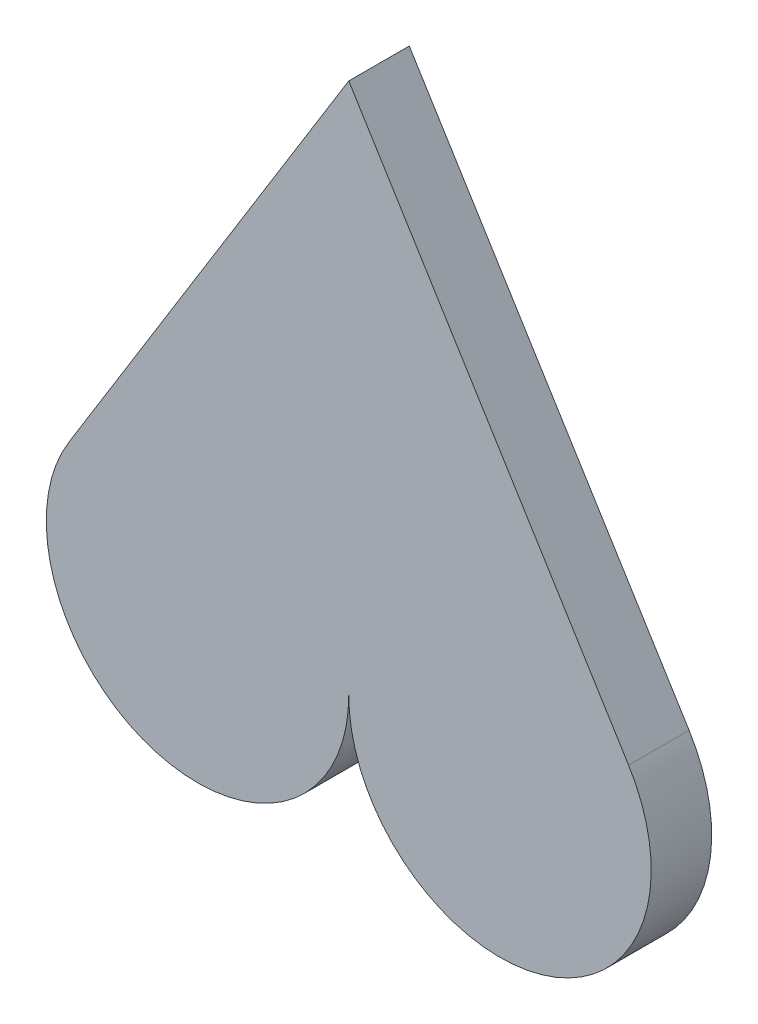
ISO-10303-21;
HEADER;
FILE_DESCRIPTION(('STEP AP214'),'2;1');
FILE_NAME('part.step','',(''),(''),'','','');
FILE_SCHEMA(('AUTOMOTIVE_DESIGN { 1 0 10303 214 1 1 1 1 }'));
ENDSEC;
DATA;
#1=APPLICATION_CONTEXT('core data for automotive mechanical design processes');
#2=APPLICATION_PROTOCOL_DEFINITION('international standard','automotive_design',2000,#1);
#3=PRODUCT_CONTEXT('',#1,'mechanical');
#4=PRODUCT('Part','Part','',(#3));
#5=PRODUCT_RELATED_PRODUCT_CATEGORY('part','',(#4));
#6=PRODUCT_DEFINITION_FORMATION('','',#4);
#7=PRODUCT_DEFINITION_CONTEXT('part definition',#1,'design');
#8=PRODUCT_DEFINITION('design','',#6,#7);
#9=PRODUCT_DEFINITION_SHAPE('','',#8);
#10=(LENGTH_UNIT() NAMED_UNIT(*) SI_UNIT(.MILLI.,.METRE.));
#11=(NAMED_UNIT(*) PLANE_ANGLE_UNIT() SI_UNIT($,.RADIAN.));
#12=(NAMED_UNIT(*) SI_UNIT($,.STERADIAN.) SOLID_ANGLE_UNIT());
#13=UNCERTAINTY_MEASURE_WITH_UNIT(LENGTH_MEASURE(1.E-05),#10,'distance_accuracy_value','');
#14=(GEOMETRIC_REPRESENTATION_CONTEXT(3) GLOBAL_UNCERTAINTY_ASSIGNED_CONTEXT((#13)) GLOBAL_UNIT_ASSIGNED_CONTEXT((#10,
#11,#12)) REPRESENTATION_CONTEXT('',''));
#15=CARTESIAN_POINT('',(0.,0.,0.));
#16=DIRECTION('',(0.,0.,1.));
#17=DIRECTION('',(1.,0.,0.));
#18=AXIS2_PLACEMENT_3D('',#15,#16,#17);
#19=CARTESIAN_POINT('',(-15.0005941465236,-52.7900822735894,-6.));
#20=DIRECTION('',(0.,0.,1.));
#21=DIRECTION('',(1.,0.,0.));
#22=AXIS2_PLACEMENT_3D('',#19,#20,#21);
#23=CYLINDRICAL_SURFACE('',#22,15.);
#24=CARTESIAN_POINT('',(-15.0005941465236,-52.7900822735894,0.));
#25=DIRECTION('',(0.,0.,1.));
#26=DIRECTION('',(1.,0.,0.));
#27=AXIS2_PLACEMENT_3D('',#24,#25,#26);
#28=CIRCLE('',#27,15.);
#29=CARTESIAN_POINT('',(-0.000594146523598404,-52.7900822735894,0.));
#30=VERTEX_POINT('',#29);
#31=CARTESIAN_POINT('',(-27.759328595598,-44.9024530189907,0.));
#32=VERTEX_POINT('',#31);
#33=EDGE_CURVE('E98',#30,#32,#28,.F.);
#34=ORIENTED_EDGE('',*,*,#33,.T.);
#35=DIRECTION('',(0.,0.,1.));
#36=VECTOR('',#35,1.);
#37=CARTESIAN_POINT('',(-27.759328595598,-44.9024530189907,-6.));
#38=LINE('',#37,#36);
#39=CARTESIAN_POINT('',(-27.759328595598,-44.9024530189907,-6.));
#40=VERTEX_POINT('',#39);
#41=EDGE_CURVE('E11',#40,#32,#38,.T.);
#42=ORIENTED_EDGE('',*,*,#41,.F.);
#43=CARTESIAN_POINT('',(-15.0005941465236,-52.7900822735894,-6.));
#44=DIRECTION('',(0.,0.,1.));
#45=DIRECTION('',(1.,0.,0.));
#46=AXIS2_PLACEMENT_3D('',#43,#44,#45);
#47=CIRCLE('',#46,15.);
#48=CARTESIAN_POINT('',(-0.000594146523598404,-52.7900822735894,-6.));
#49=VERTEX_POINT('',#48);
#50=EDGE_CURVE('E53',#49,#40,#47,.F.);
#51=ORIENTED_EDGE('',*,*,#50,.F.);
#52=DIRECTION('',(0.,0.,1.));
#53=VECTOR('',#52,1.);
#54=CARTESIAN_POINT('',(-0.000594146523598404,-52.7900822735894,-6.));
#55=LINE('',#54,#53);
#56=EDGE_CURVE('E38',#49,#30,#55,.T.);
#57=ORIENTED_EDGE('',*,*,#56,.T.);
#58=EDGE_LOOP('',(#34,#42,#51,#57));
#59=FACE_BOUND('',#58,.T.);
#60=ADVANCED_FACE('F35',(#59),#23,.T.);
#61=CARTESIAN_POINT('',(0.,0.,-6.));
#62=DIRECTION('',(-0.850582296604963,0.525841950306579,0.));
#63=DIRECTION('',(-0.525841950306579,-0.850582296604963,0.));
#64=AXIS2_PLACEMENT_3D('',#61,#62,#63);
#65=PLANE('',#64);
#66=DIRECTION('',(-0.525841950306579,-0.850582296604963,0.));
#67=VECTOR('',#66,1.);
#68=CARTESIAN_POINT('',(0.,0.,0.));
#69=LINE('',#68,#67);
#70=CARTESIAN_POINT('',(-0.000594146523600139,-0.000961069222927188,0.));
#71=VERTEX_POINT('',#70);
#72=EDGE_CURVE('E94',#71,#32,#69,.T.);
#73=ORIENTED_EDGE('',*,*,#72,.F.);
#74=DIRECTION('',(0.,0.,1.));
#75=VECTOR('',#74,1.);
#76=CARTESIAN_POINT('',(-0.000594146523600139,-0.000961069222927188,-6.));
#77=LINE('',#76,#75);
#78=CARTESIAN_POINT('',(-0.000594146523600139,-0.000961069222927188,-6.));
#79=VERTEX_POINT('',#78);
#80=EDGE_CURVE('E44',#79,#71,#77,.T.);
#81=ORIENTED_EDGE('',*,*,#80,.F.);
#82=DIRECTION('',(-0.525841950306579,-0.850582296604963,0.));
#83=VECTOR('',#82,1.);
#84=CARTESIAN_POINT('',(0.,0.,-6.));
#85=LINE('',#84,#83);
#86=EDGE_CURVE('E86',#79,#40,#85,.T.);
#87=ORIENTED_EDGE('',*,*,#86,.T.);
#88=ORIENTED_EDGE('',*,*,#41,.T.);
#89=EDGE_LOOP('',(#73,#81,#87,#88));
#90=FACE_BOUND('',#89,.T.);
#91=ADVANCED_FACE('F108',(#90),#65,.T.);
#92=CARTESIAN_POINT('',(-0.000859718425827981,-0.00053149003401119,-6.));
#93=DIRECTION('',(-0.850582296604963,-0.525841950306579,0.));
#94=DIRECTION('',(0.525841950306579,-0.850582296604963,0.));
#95=AXIS2_PLACEMENT_3D('',#92,#93,#94);
#96=PLANE('',#95);
#97=DIRECTION('',(0.525841950306579,-0.850582296604963,0.));
#98=VECTOR('',#97,1.);
#99=CARTESIAN_POINT('',(-0.000859718425827981,-0.00053149003401119,0.));
#100=LINE('',#99,#98);
#101=CARTESIAN_POINT('',(27.7581403025508,-44.9024530189907,0.));
#102=VERTEX_POINT('',#101);
#103=EDGE_CURVE('E90',#71,#102,#100,.T.);
#104=ORIENTED_EDGE('',*,*,#103,.T.);
#105=DIRECTION('',(0.,0.,1.));
#106=VECTOR('',#105,1.);
#107=CARTESIAN_POINT('',(27.7581403025508,-44.9024530189907,-6.));
#108=LINE('',#107,#106);
#109=CARTESIAN_POINT('',(27.7581403025508,-44.9024530189907,-6.));
#110=VERTEX_POINT('',#109);
#111=EDGE_CURVE('E88',#110,#102,#108,.T.);
#112=ORIENTED_EDGE('',*,*,#111,.F.);
#113=DIRECTION('',(0.525841950306579,-0.850582296604963,0.));
#114=VECTOR('',#113,1.);
#115=CARTESIAN_POINT('',(-0.000859718425827981,-0.00053149003401119,-6.));
#116=LINE('',#115,#114);
#117=EDGE_CURVE('E82',#79,#110,#116,.T.);
#118=ORIENTED_EDGE('',*,*,#117,.F.);
#119=ORIENTED_EDGE('',*,*,#80,.T.);
#120=EDGE_LOOP('',(#104,#112,#118,#119));
#121=FACE_BOUND('',#120,.T.);
#122=ADVANCED_FACE('F89',(#121),#96,.F.);
#123=CARTESIAN_POINT('',(14.9994058534764,-52.7900822735894,-6.));
#124=DIRECTION('',(0.,0.,1.));
#125=DIRECTION('',(1.,0.,0.));
#126=AXIS2_PLACEMENT_3D('',#123,#124,#125);
#127=CYLINDRICAL_SURFACE('',#126,15.);
#128=CARTESIAN_POINT('',(14.9994058534764,-52.7900822735894,0.));
#129=DIRECTION('',(0.,0.,1.));
#130=DIRECTION('',(1.,0.,0.));
#131=AXIS2_PLACEMENT_3D('',#128,#129,#130);
#132=CIRCLE('',#131,15.);
#133=EDGE_CURVE('E100',#30,#102,#132,.T.);
#134=ORIENTED_EDGE('',*,*,#133,.F.);
#135=ORIENTED_EDGE('',*,*,#56,.F.);
#136=CARTESIAN_POINT('',(14.9994058534764,-52.7900822735894,-6.));
#137=DIRECTION('',(0.,0.,1.));
#138=DIRECTION('',(1.,0.,0.));
#139=AXIS2_PLACEMENT_3D('',#136,#137,#138);
#140=CIRCLE('',#139,15.);
#141=EDGE_CURVE('E85',#49,#110,#140,.T.);
#142=ORIENTED_EDGE('',*,*,#141,.T.);
#143=ORIENTED_EDGE('',*,*,#111,.T.);
#144=EDGE_LOOP('',(#134,#135,#142,#143));
#145=FACE_BOUND('',#144,.T.);
#146=ADVANCED_FACE('F92',(#145),#127,.T.);
#147=CARTESIAN_POINT('',(0.,0.,-6.));
#148=DIRECTION('',(0.,0.,1.));
#149=DIRECTION('',(1.,0.,0.));
#150=AXIS2_PLACEMENT_3D('',#147,#148,#149);
#151=PLANE('',#150);
#152=ORIENTED_EDGE('',*,*,#50,.T.);
#153=ORIENTED_EDGE('',*,*,#86,.F.);
#154=ORIENTED_EDGE('',*,*,#117,.T.);
#155=ORIENTED_EDGE('',*,*,#141,.F.);
#156=EDGE_LOOP('',(#152,#153,#154,#155));
#157=FACE_BOUND('',#156,.T.);
#158=ADVANCED_FACE('F84',(#157),#151,.F.);
#159=CARTESIAN_POINT('',(0.,0.,0.));
#160=DIRECTION('',(0.,0.,1.));
#161=DIRECTION('',(1.,0.,0.));
#162=AXIS2_PLACEMENT_3D('',#159,#160,#161);
#163=PLANE('',#162);
#164=ORIENTED_EDGE('',*,*,#33,.F.);
#165=ORIENTED_EDGE('',*,*,#133,.T.);
#166=ORIENTED_EDGE('',*,*,#103,.F.);
#167=ORIENTED_EDGE('',*,*,#72,.T.);
#168=EDGE_LOOP('',(#164,#165,#166,#167));
#169=FACE_BOUND('',#168,.T.);
#170=ADVANCED_FACE('F107',(#169),#163,.T.);
#171=CLOSED_SHELL('',(#60,#91,#122,#146,#158,#170));
#172=MANIFOLD_SOLID_BREP('B2',#171);
#173=ADVANCED_BREP_SHAPE_REPRESENTATION('',(#18,#172),#14);
#174=SHAPE_DEFINITION_REPRESENTATION(#9,#173);
ENDSEC;
END-ISO-10303-21;
